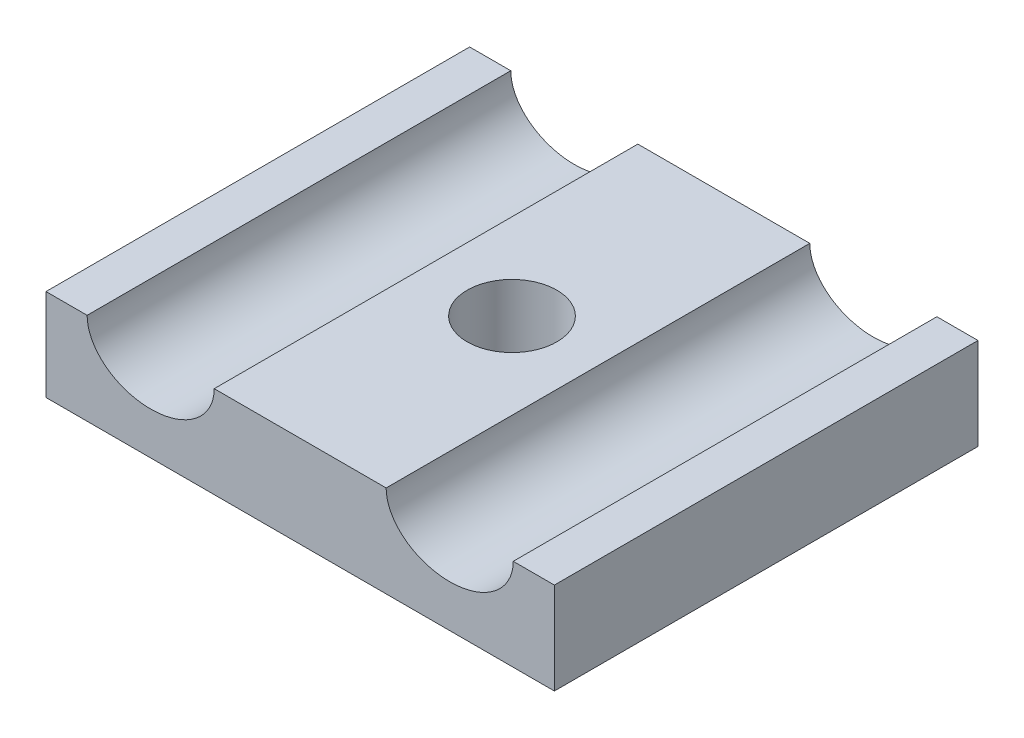
ISO-10303-21;
HEADER;
FILE_DESCRIPTION(('STEP AP214'),'2;1');
FILE_NAME('part.step','',(''),(''),'','','');
FILE_SCHEMA(('AUTOMOTIVE_DESIGN { 1 0 10303 214 1 1 1 1 }'));
ENDSEC;
DATA;
#1=APPLICATION_CONTEXT('core data for automotive mechanical design processes');
#2=APPLICATION_PROTOCOL_DEFINITION('international standard','automotive_design',2000,#1);
#3=PRODUCT_CONTEXT('',#1,'mechanical');
#4=PRODUCT('Part','Part','',(#3));
#5=PRODUCT_RELATED_PRODUCT_CATEGORY('part','',(#4));
#6=PRODUCT_DEFINITION_FORMATION('','',#4);
#7=PRODUCT_DEFINITION_CONTEXT('part definition',#1,'design');
#8=PRODUCT_DEFINITION('design','',#6,#7);
#9=PRODUCT_DEFINITION_SHAPE('','',#8);
#10=(LENGTH_UNIT() NAMED_UNIT(*) SI_UNIT(.MILLI.,.METRE.));
#11=(NAMED_UNIT(*) PLANE_ANGLE_UNIT() SI_UNIT($,.RADIAN.));
#12=(NAMED_UNIT(*) SI_UNIT($,.STERADIAN.) SOLID_ANGLE_UNIT());
#13=UNCERTAINTY_MEASURE_WITH_UNIT(LENGTH_MEASURE(1.E-05),#10,'distance_accuracy_value','');
#14=(GEOMETRIC_REPRESENTATION_CONTEXT(3) GLOBAL_UNCERTAINTY_ASSIGNED_CONTEXT((#13)) GLOBAL_UNIT_ASSIGNED_CONTEXT((#10,
#11,#12)) REPRESENTATION_CONTEXT('',''));
#15=CARTESIAN_POINT('',(0.,0.,0.));
#16=DIRECTION('',(0.,0.,1.));
#17=DIRECTION('',(1.,0.,0.));
#18=AXIS2_PLACEMENT_3D('',#15,#16,#17);
#19=CARTESIAN_POINT('',(0.,6.5,0.));
#20=DIRECTION('',(0.,-1.,0.));
#21=DIRECTION('',(0.,0.,-1.));
#22=AXIS2_PLACEMENT_3D('',#19,#20,#21);
#23=PLANE('',#22);
#24=CARTESIAN_POINT('',(-18.,6.5,15.));
#25=DIRECTION('',(0.,1.,0.));
#26=DIRECTION('',(0.,0.,1.));
#27=AXIS2_PLACEMENT_3D('',#24,#25,#26);
#28=CIRCLE('',#27,3.175);
#29=CARTESIAN_POINT('',(-18.,6.5,18.175));
#30=VERTEX_POINT('',#29);
#31=EDGE_CURVE('E201',#30,#30,#28,.T.);
#32=ORIENTED_EDGE('',*,*,#31,.F.);
#33=EDGE_LOOP('',(#32));
#34=FACE_BOUND('',#33,.T.);
#35=DIRECTION('',(-1.,0.,0.));
#36=VECTOR('',#35,1.);
#37=CARTESIAN_POINT('',(0.,6.5,0.));
#38=LINE('',#37,#36);
#39=CARTESIAN_POINT('',(-11.9125,6.5,0.));
#40=VERTEX_POINT('',#39);
#41=CARTESIAN_POINT('',(-24.0875,6.5,0.));
#42=VERTEX_POINT('',#41);
#43=EDGE_CURVE('E105',#40,#42,#38,.T.);
#44=ORIENTED_EDGE('',*,*,#43,.T.);
#45=DIRECTION('',(0.,0.,1.));
#46=VECTOR('',#45,1.);
#47=CARTESIAN_POINT('',(-24.0875,6.5,15.));
#48=LINE('',#47,#46);
#49=CARTESIAN_POINT('',(-24.0875,6.5,30.));
#50=VERTEX_POINT('',#49);
#51=EDGE_CURVE('E11',#42,#50,#48,.T.);
#52=ORIENTED_EDGE('',*,*,#51,.T.);
#53=DIRECTION('',(1.,0.,0.));
#54=VECTOR('',#53,1.);
#55=CARTESIAN_POINT('',(0.,6.5,30.));
#56=LINE('',#55,#54);
#57=CARTESIAN_POINT('',(-11.9125,6.5,30.));
#58=VERTEX_POINT('',#57);
#59=EDGE_CURVE('E124',#50,#58,#56,.T.);
#60=ORIENTED_EDGE('',*,*,#59,.T.);
#61=DIRECTION('',(0.,0.,1.));
#62=VECTOR('',#61,1.);
#63=CARTESIAN_POINT('',(-11.9125,6.5,15.));
#64=LINE('',#63,#62);
#65=EDGE_CURVE('E109',#58,#40,#64,.F.);
#66=ORIENTED_EDGE('',*,*,#65,.T.);
#67=EDGE_LOOP('',(#44,#52,#60,#66));
#68=FACE_BOUND('',#67,.T.);
#69=ADVANCED_FACE('F32',(#34,#68),#23,.F.);
#70=CARTESIAN_POINT('',(0.,6.5,0.));
#71=VERTEX_POINT('',#70);
#72=CARTESIAN_POINT('',(-2.91249999999999,6.5,0.));
#73=VERTEX_POINT('',#72);
#74=EDGE_CURVE('E110',#71,#73,#38,.T.);
#75=ORIENTED_EDGE('',*,*,#74,.T.);
#76=DIRECTION('',(0.,0.,1.));
#77=VECTOR('',#76,1.);
#78=CARTESIAN_POINT('',(-2.91249999999999,6.5,15.));
#79=LINE('',#78,#77);
#80=CARTESIAN_POINT('',(-2.91249999999999,6.5,30.));
#81=VERTEX_POINT('',#80);
#82=EDGE_CURVE('E147',#73,#81,#79,.T.);
#83=ORIENTED_EDGE('',*,*,#82,.T.);
#84=CARTESIAN_POINT('',(0.,6.5,30.));
#85=VERTEX_POINT('',#84);
#86=EDGE_CURVE('E119',#81,#85,#56,.T.);
#87=ORIENTED_EDGE('',*,*,#86,.T.);
#88=DIRECTION('',(0.,0.,-1.));
#89=VECTOR('',#88,1.);
#90=CARTESIAN_POINT('',(0.,6.5,0.));
#91=LINE('',#90,#89);
#92=EDGE_CURVE('E114',#85,#71,#91,.T.);
#93=ORIENTED_EDGE('',*,*,#92,.T.);
#94=EDGE_LOOP('',(#75,#83,#87,#93));
#95=FACE_BOUND('',#94,.T.);
#96=ADVANCED_FACE('F179',(#95),#23,.F.);
#97=CARTESIAN_POINT('',(0.,6.5,0.));
#98=DIRECTION('',(-1.,0.,0.));
#99=DIRECTION('',(0.,0.,1.));
#100=AXIS2_PLACEMENT_3D('',#97,#98,#99);
#101=PLANE('',#100);
#102=DIRECTION('',(0.,0.,-1.));
#103=VECTOR('',#102,1.);
#104=CARTESIAN_POINT('',(0.,0.,0.));
#105=LINE('',#104,#103);
#106=CARTESIAN_POINT('',(0.,0.,30.));
#107=VERTEX_POINT('',#106);
#108=CARTESIAN_POINT('',(0.,0.,0.));
#109=VERTEX_POINT('',#108);
#110=EDGE_CURVE('E125',#107,#109,#105,.T.);
#111=ORIENTED_EDGE('',*,*,#110,.T.);
#112=DIRECTION('',(0.,-1.,0.));
#113=VECTOR('',#112,1.);
#114=CARTESIAN_POINT('',(0.,6.5,0.));
#115=LINE('',#114,#113);
#116=EDGE_CURVE('E143',#71,#109,#115,.T.);
#117=ORIENTED_EDGE('',*,*,#116,.F.);
#118=ORIENTED_EDGE('',*,*,#92,.F.);
#119=DIRECTION('',(0.,-1.,0.));
#120=VECTOR('',#119,1.);
#121=CARTESIAN_POINT('',(0.,6.5,30.));
#122=LINE('',#121,#120);
#123=EDGE_CURVE('E123',#85,#107,#122,.T.);
#124=ORIENTED_EDGE('',*,*,#123,.T.);
#125=EDGE_LOOP('',(#111,#117,#118,#124));
#126=FACE_BOUND('',#125,.T.);
#127=ADVANCED_FACE('F34',(#126),#101,.F.);
#128=CARTESIAN_POINT('',(0.,6.5,0.));
#129=DIRECTION('',(0.,0.,1.));
#130=DIRECTION('',(1.,0.,0.));
#131=AXIS2_PLACEMENT_3D('',#128,#129,#130);
#132=PLANE('',#131);
#133=CARTESIAN_POINT('',(-33.0875,6.5,0.));
#134=VERTEX_POINT('',#133);
#135=CARTESIAN_POINT('',(-36.,6.5,0.));
#136=VERTEX_POINT('',#135);
#137=EDGE_CURVE('E107',#134,#136,#38,.T.);
#138=ORIENTED_EDGE('',*,*,#137,.F.);
#139=CARTESIAN_POINT('',(-28.5875,6.5,0.));
#140=DIRECTION('',(0.,0.,1.));
#141=DIRECTION('',(-1.,0.,0.));
#142=AXIS2_PLACEMENT_3D('',#139,#140,#141);
#143=ELLIPSE('',#142,4.5,3.5);
#144=EDGE_CURVE('E47',#42,#134,#143,.F.);
#145=ORIENTED_EDGE('',*,*,#144,.F.);
#146=ORIENTED_EDGE('',*,*,#43,.F.);
#147=CARTESIAN_POINT('',(-7.4125,6.5,0.));
#148=DIRECTION('',(0.,0.,1.));
#149=DIRECTION('',(-1.,0.,0.));
#150=AXIS2_PLACEMENT_3D('',#147,#148,#149);
#151=ELLIPSE('',#150,4.5,3.5);
#152=EDGE_CURVE('E55',#73,#40,#151,.F.);
#153=ORIENTED_EDGE('',*,*,#152,.F.);
#154=ORIENTED_EDGE('',*,*,#74,.F.);
#155=ORIENTED_EDGE('',*,*,#116,.T.);
#156=DIRECTION('',(-1.,0.,0.));
#157=VECTOR('',#156,1.);
#158=CARTESIAN_POINT('',(0.,0.,0.));
#159=LINE('',#158,#157);
#160=CARTESIAN_POINT('',(-36.,0.,0.));
#161=VERTEX_POINT('',#160);
#162=EDGE_CURVE('E128',#109,#161,#159,.T.);
#163=ORIENTED_EDGE('',*,*,#162,.T.);
#164=DIRECTION('',(0.,-1.,0.));
#165=VECTOR('',#164,1.);
#166=CARTESIAN_POINT('',(-36.,6.5,0.));
#167=LINE('',#166,#165);
#168=EDGE_CURVE('E140',#136,#161,#167,.T.);
#169=ORIENTED_EDGE('',*,*,#168,.F.);
#170=EDGE_LOOP('',(#138,#145,#146,#153,#154,#155,#163,#169));
#171=FACE_BOUND('',#170,.T.);
#172=ADVANCED_FACE('F104',(#171),#132,.F.);
#173=CARTESIAN_POINT('',(-36.,6.5,0.));
#174=DIRECTION('',(1.,0.,0.));
#175=DIRECTION('',(0.,0.,-1.));
#176=AXIS2_PLACEMENT_3D('',#173,#174,#175);
#177=PLANE('',#176);
#178=DIRECTION('',(0.,0.,1.));
#179=VECTOR('',#178,1.);
#180=CARTESIAN_POINT('',(-36.,0.,0.));
#181=LINE('',#180,#179);
#182=CARTESIAN_POINT('',(-36.,0.,30.));
#183=VERTEX_POINT('',#182);
#184=EDGE_CURVE('E131',#161,#183,#181,.T.);
#185=ORIENTED_EDGE('',*,*,#184,.T.);
#186=DIRECTION('',(0.,-1.,0.));
#187=VECTOR('',#186,1.);
#188=CARTESIAN_POINT('',(-36.,6.5,30.));
#189=LINE('',#188,#187);
#190=CARTESIAN_POINT('',(-36.,6.5,30.));
#191=VERTEX_POINT('',#190);
#192=EDGE_CURVE('E137',#191,#183,#189,.T.);
#193=ORIENTED_EDGE('',*,*,#192,.F.);
#194=DIRECTION('',(0.,0.,1.));
#195=VECTOR('',#194,1.);
#196=CARTESIAN_POINT('',(-36.,6.5,0.));
#197=LINE('',#196,#195);
#198=EDGE_CURVE('E113',#136,#191,#197,.T.);
#199=ORIENTED_EDGE('',*,*,#198,.F.);
#200=ORIENTED_EDGE('',*,*,#168,.T.);
#201=EDGE_LOOP('',(#185,#193,#199,#200));
#202=FACE_BOUND('',#201,.T.);
#203=ADVANCED_FACE('F185',(#202),#177,.F.);
#204=CARTESIAN_POINT('',(0.,6.5,30.));
#205=DIRECTION('',(0.,0.,-1.));
#206=DIRECTION('',(-1.,0.,0.));
#207=AXIS2_PLACEMENT_3D('',#204,#205,#206);
#208=PLANE('',#207);
#209=ORIENTED_EDGE('',*,*,#59,.F.);
#210=CARTESIAN_POINT('',(-28.5875,6.5,30.));
#211=DIRECTION('',(0.,0.,1.));
#212=DIRECTION('',(-1.,0.,0.));
#213=AXIS2_PLACEMENT_3D('',#210,#211,#212);
#214=ELLIPSE('',#213,4.5,3.5);
#215=CARTESIAN_POINT('',(-33.0875,6.5,30.));
#216=VERTEX_POINT('',#215);
#217=EDGE_CURVE('E97',#216,#50,#214,.T.);
#218=ORIENTED_EDGE('',*,*,#217,.F.);
#219=EDGE_CURVE('E120',#191,#216,#56,.T.);
#220=ORIENTED_EDGE('',*,*,#219,.F.);
#221=ORIENTED_EDGE('',*,*,#192,.T.);
#222=DIRECTION('',(1.,0.,0.));
#223=VECTOR('',#222,1.);
#224=CARTESIAN_POINT('',(0.,0.,30.));
#225=LINE('',#224,#223);
#226=EDGE_CURVE('E133',#183,#107,#225,.T.);
#227=ORIENTED_EDGE('',*,*,#226,.T.);
#228=ORIENTED_EDGE('',*,*,#123,.F.);
#229=ORIENTED_EDGE('',*,*,#86,.F.);
#230=CARTESIAN_POINT('',(-7.4125,6.5,30.));
#231=DIRECTION('',(0.,0.,1.));
#232=DIRECTION('',(-1.,0.,0.));
#233=AXIS2_PLACEMENT_3D('',#230,#231,#232);
#234=ELLIPSE('',#233,4.5,3.5);
#235=EDGE_CURVE('E155',#58,#81,#234,.T.);
#236=ORIENTED_EDGE('',*,*,#235,.F.);
#237=EDGE_LOOP('',(#209,#218,#220,#221,#227,#228,#229,#236));
#238=FACE_BOUND('',#237,.T.);
#239=ADVANCED_FACE('F153',(#238),#208,.F.);
#240=ORIENTED_EDGE('',*,*,#219,.T.);
#241=DIRECTION('',(0.,0.,1.));
#242=VECTOR('',#241,1.);
#243=CARTESIAN_POINT('',(-33.0875,6.5,15.));
#244=LINE('',#243,#242);
#245=EDGE_CURVE('E40',#216,#134,#244,.F.);
#246=ORIENTED_EDGE('',*,*,#245,.T.);
#247=ORIENTED_EDGE('',*,*,#137,.T.);
#248=ORIENTED_EDGE('',*,*,#198,.T.);
#249=EDGE_LOOP('',(#240,#246,#247,#248));
#250=FACE_BOUND('',#249,.T.);
#251=ADVANCED_FACE('F150',(#250),#23,.F.);
#252=CARTESIAN_POINT('',(0.,0.,0.));
#253=DIRECTION('',(0.,-1.,0.));
#254=DIRECTION('',(0.,0.,-1.));
#255=AXIS2_PLACEMENT_3D('',#252,#253,#254);
#256=PLANE('',#255);
#257=ORIENTED_EDGE('',*,*,#110,.F.);
#258=ORIENTED_EDGE('',*,*,#226,.F.);
#259=ORIENTED_EDGE('',*,*,#184,.F.);
#260=ORIENTED_EDGE('',*,*,#162,.F.);
#261=EDGE_LOOP('',(#257,#258,#259,#260));
#262=FACE_BOUND('',#261,.T.);
#263=ADVANCED_FACE('F175',(#262),#256,.T.);
#264=CARTESIAN_POINT('',(-18.,1.5,15.));
#265=DIRECTION('',(0.,1.,0.));
#266=DIRECTION('',(0.,0.,1.));
#267=AXIS2_PLACEMENT_3D('',#264,#265,#266);
#268=CYLINDRICAL_SURFACE('',#267,3.175);
#269=CARTESIAN_POINT('',(-18.,1.5,15.));
#270=DIRECTION('',(0.,1.,0.));
#271=DIRECTION('',(0.,0.,1.));
#272=AXIS2_PLACEMENT_3D('',#269,#270,#271);
#273=CIRCLE('',#272,3.175);
#274=CARTESIAN_POINT('',(-18.,1.5,18.175));
#275=VERTEX_POINT('',#274);
#276=EDGE_CURVE('E129',#275,#275,#273,.T.);
#277=ORIENTED_EDGE('',*,*,#276,.F.);
#278=EDGE_LOOP('',(#277));
#279=FACE_BOUND('',#278,.T.);
#280=ORIENTED_EDGE('',*,*,#31,.T.);
#281=EDGE_LOOP('',(#280));
#282=FACE_BOUND('',#281,.T.);
#283=ADVANCED_FACE('F171',(#279,#282),#268,.F.);
#284=CARTESIAN_POINT('',(-18.,1.5,15.));
#285=DIRECTION('',(0.,1.,0.));
#286=DIRECTION('',(0.,0.,1.));
#287=AXIS2_PLACEMENT_3D('',#284,#285,#286);
#288=PLANE('',#287);
#289=ORIENTED_EDGE('',*,*,#276,.T.);
#290=EDGE_LOOP('',(#289));
#291=FACE_BOUND('',#290,.T.);
#292=ADVANCED_FACE('F168',(#291),#288,.T.);
#293=CARTESIAN_POINT('',(-7.4125,6.5,-11.4017542509914));
#294=DIRECTION('',(0.,0.,1.));
#295=DIRECTION('',(-1.,0.,0.));
#296=AXIS2_PLACEMENT_3D('',#293,#294,#295);
#297=ELLIPSE('',#296,4.5,3.5);
#298=DIRECTION('',(0.,0.,1.));
#299=VECTOR('',#298,1.);
#300=SURFACE_OF_LINEAR_EXTRUSION('',#297,#299);
#301=ORIENTED_EDGE('',*,*,#152,.T.);
#302=ORIENTED_EDGE('',*,*,#65,.F.);
#303=ORIENTED_EDGE('',*,*,#235,.T.);
#304=ORIENTED_EDGE('',*,*,#82,.F.);
#305=EDGE_LOOP('',(#301,#302,#303,#304));
#306=FACE_BOUND('',#305,.T.);
#307=ADVANCED_FACE('F165',(#306),#300,.F.);
#308=CARTESIAN_POINT('',(-28.5875,6.5,-11.4017542509914));
#309=DIRECTION('',(0.,0.,1.));
#310=DIRECTION('',(-1.,0.,0.));
#311=AXIS2_PLACEMENT_3D('',#308,#309,#310);
#312=ELLIPSE('',#311,4.5,3.5);
#313=DIRECTION('',(0.,0.,1.));
#314=VECTOR('',#313,1.);
#315=SURFACE_OF_LINEAR_EXTRUSION('',#312,#314);
#316=ORIENTED_EDGE('',*,*,#144,.T.);
#317=ORIENTED_EDGE('',*,*,#245,.F.);
#318=ORIENTED_EDGE('',*,*,#217,.T.);
#319=ORIENTED_EDGE('',*,*,#51,.F.);
#320=EDGE_LOOP('',(#316,#317,#318,#319));
#321=FACE_BOUND('',#320,.T.);
#322=ADVANCED_FACE('F95',(#321),#315,.F.);
#323=CLOSED_SHELL('',(#69,#96,#127,#172,#203,#239,#251,#263,#283,#292,#307,#322));
#324=MANIFOLD_SOLID_BREP('B2',#323);
#325=ADVANCED_BREP_SHAPE_REPRESENTATION('',(#18,#324),#14);
#326=SHAPE_DEFINITION_REPRESENTATION(#9,#325);
ENDSEC;
END-ISO-10303-21;
